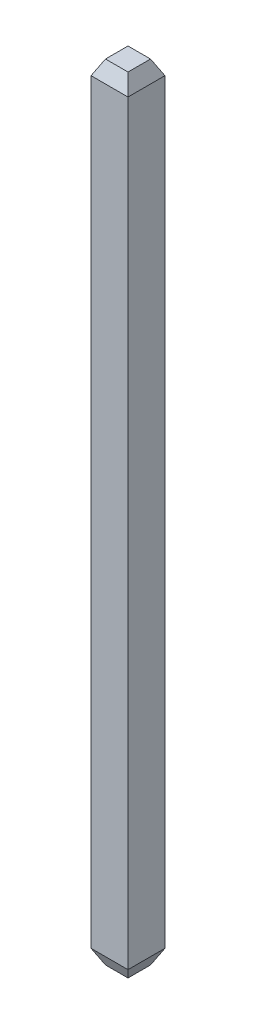
ISO-10303-21;
HEADER;
FILE_DESCRIPTION(('STEP AP214'),'2;1');
FILE_NAME('part.step','',(''),(''),'','','');
FILE_SCHEMA(('AUTOMOTIVE_DESIGN { 1 0 10303 214 1 1 1 1 }'));
ENDSEC;
DATA;
#1=APPLICATION_CONTEXT('core data for automotive mechanical design processes');
#2=APPLICATION_PROTOCOL_DEFINITION('international standard','automotive_design',2000,#1);
#3=PRODUCT_CONTEXT('',#1,'mechanical');
#4=PRODUCT('Part','Part','',(#3));
#5=PRODUCT_RELATED_PRODUCT_CATEGORY('part','',(#4));
#6=PRODUCT_DEFINITION_FORMATION('','',#4);
#7=PRODUCT_DEFINITION_CONTEXT('part definition',#1,'design');
#8=PRODUCT_DEFINITION('design','',#6,#7);
#9=PRODUCT_DEFINITION_SHAPE('','',#8);
#10=(LENGTH_UNIT() NAMED_UNIT(*) SI_UNIT(.MILLI.,.METRE.));
#11=(NAMED_UNIT(*) PLANE_ANGLE_UNIT() SI_UNIT($,.RADIAN.));
#12=(NAMED_UNIT(*) SI_UNIT($,.STERADIAN.) SOLID_ANGLE_UNIT());
#13=UNCERTAINTY_MEASURE_WITH_UNIT(LENGTH_MEASURE(1.E-05),#10,'distance_accuracy_value','');
#14=(GEOMETRIC_REPRESENTATION_CONTEXT(3) GLOBAL_UNCERTAINTY_ASSIGNED_CONTEXT((#13)) GLOBAL_UNIT_ASSIGNED_CONTEXT((#10,
#11,#12)) REPRESENTATION_CONTEXT('',''));
#15=CARTESIAN_POINT('',(0.,0.,0.));
#16=DIRECTION('',(0.,0.,1.));
#17=DIRECTION('',(1.,0.,0.));
#18=AXIS2_PLACEMENT_3D('',#15,#16,#17);
#19=CARTESIAN_POINT('',(0.32,13.59,-0.32));
#20=DIRECTION('',(-1.,0.,0.));
#21=DIRECTION('',(0.,0.,1.));
#22=AXIS2_PLACEMENT_3D('',#19,#20,#21);
#23=PLANE('',#22);
#24=DIRECTION('',(0.,-1.,0.));
#25=VECTOR('',#24,1.);
#26=CARTESIAN_POINT('',(0.32,13.59,0.32));
#27=LINE('',#26,#25);
#28=CARTESIAN_POINT('',(0.32,13.34,0.32));
#29=VERTEX_POINT('',#28);
#30=CARTESIAN_POINT('',(0.32,0.25,0.32));
#31=VERTEX_POINT('',#30);
#32=EDGE_CURVE('E121',#29,#31,#27,.T.);
#33=ORIENTED_EDGE('',*,*,#32,.T.);
#34=DIRECTION('',(0.,0.,-1.));
#35=VECTOR('',#34,1.);
#36=CARTESIAN_POINT('',(0.32,0.25,-0.32));
#37=LINE('',#36,#35);
#38=CARTESIAN_POINT('',(0.32,0.25,-0.32));
#39=VERTEX_POINT('',#38);
#40=EDGE_CURVE('E11',#31,#39,#37,.T.);
#41=ORIENTED_EDGE('',*,*,#40,.T.);
#42=DIRECTION('',(0.,-1.,0.));
#43=VECTOR('',#42,1.);
#44=CARTESIAN_POINT('',(0.32,13.59,-0.32));
#45=LINE('',#44,#43);
#46=CARTESIAN_POINT('',(0.32,13.34,-0.32));
#47=VERTEX_POINT('',#46);
#48=EDGE_CURVE('E127',#47,#39,#45,.T.);
#49=ORIENTED_EDGE('',*,*,#48,.F.);
#50=DIRECTION('',(0.,0.,1.));
#51=VECTOR('',#50,1.);
#52=CARTESIAN_POINT('',(0.32,13.34,0.32));
#53=LINE('',#52,#51);
#54=EDGE_CURVE('E143',#47,#29,#53,.T.);
#55=ORIENTED_EDGE('',*,*,#54,.T.);
#56=EDGE_LOOP('',(#33,#41,#49,#55));
#57=FACE_BOUND('',#56,.T.);
#58=ADVANCED_FACE('F34',(#57),#23,.F.);
#59=CARTESIAN_POINT('',(-0.32,13.59,-0.32));
#60=DIRECTION('',(0.,0.,1.));
#61=DIRECTION('',(1.,0.,0.));
#62=AXIS2_PLACEMENT_3D('',#59,#60,#61);
#63=PLANE('',#62);
#64=ORIENTED_EDGE('',*,*,#48,.T.);
#65=DIRECTION('',(-1.,0.,0.));
#66=VECTOR('',#65,1.);
#67=CARTESIAN_POINT('',(-0.32,0.25,-0.32));
#68=LINE('',#67,#66);
#69=CARTESIAN_POINT('',(-0.32,0.25,-0.32));
#70=VERTEX_POINT('',#69);
#71=EDGE_CURVE('E145',#39,#70,#68,.T.);
#72=ORIENTED_EDGE('',*,*,#71,.T.);
#73=DIRECTION('',(0.,-1.,0.));
#74=VECTOR('',#73,1.);
#75=CARTESIAN_POINT('',(-0.32,13.59,-0.32));
#76=LINE('',#75,#74);
#77=CARTESIAN_POINT('',(-0.32,13.34,-0.32));
#78=VERTEX_POINT('',#77);
#79=EDGE_CURVE('E130',#78,#70,#76,.T.);
#80=ORIENTED_EDGE('',*,*,#79,.F.);
#81=DIRECTION('',(1.,0.,0.));
#82=VECTOR('',#81,1.);
#83=CARTESIAN_POINT('',(0.32,13.34,-0.32));
#84=LINE('',#83,#82);
#85=EDGE_CURVE('E137',#78,#47,#84,.T.);
#86=ORIENTED_EDGE('',*,*,#85,.T.);
#87=EDGE_LOOP('',(#64,#72,#80,#86));
#88=FACE_BOUND('',#87,.T.);
#89=ADVANCED_FACE('F190',(#88),#63,.F.);
#90=CARTESIAN_POINT('',(-0.32,13.59,-0.32));
#91=DIRECTION('',(1.,0.,0.));
#92=DIRECTION('',(0.,0.,-1.));
#93=AXIS2_PLACEMENT_3D('',#90,#91,#92);
#94=PLANE('',#93);
#95=ORIENTED_EDGE('',*,*,#79,.T.);
#96=DIRECTION('',(0.,0.,1.));
#97=VECTOR('',#96,1.);
#98=CARTESIAN_POINT('',(-0.32,0.25,-0.32));
#99=LINE('',#98,#97);
#100=CARTESIAN_POINT('',(-0.32,0.25,0.32));
#101=VERTEX_POINT('',#100);
#102=EDGE_CURVE('E58',#70,#101,#99,.T.);
#103=ORIENTED_EDGE('',*,*,#102,.T.);
#104=DIRECTION('',(0.,-1.,0.));
#105=VECTOR('',#104,1.);
#106=CARTESIAN_POINT('',(-0.32,13.59,0.32));
#107=LINE('',#106,#105);
#108=CARTESIAN_POINT('',(-0.32,13.34,0.32));
#109=VERTEX_POINT('',#108);
#110=EDGE_CURVE('E195',#109,#101,#107,.T.);
#111=ORIENTED_EDGE('',*,*,#110,.F.);
#112=DIRECTION('',(0.,0.,-1.));
#113=VECTOR('',#112,1.);
#114=CARTESIAN_POINT('',(-0.32,13.34,-0.32));
#115=LINE('',#114,#113);
#116=EDGE_CURVE('E140',#109,#78,#115,.T.);
#117=ORIENTED_EDGE('',*,*,#116,.T.);
#118=EDGE_LOOP('',(#95,#103,#111,#117));
#119=FACE_BOUND('',#118,.T.);
#120=ADVANCED_FACE('F193',(#119),#94,.F.);
#121=CARTESIAN_POINT('',(-0.32,13.59,0.32));
#122=DIRECTION('',(0.,0.,-1.));
#123=DIRECTION('',(-1.,0.,0.));
#124=AXIS2_PLACEMENT_3D('',#121,#122,#123);
#125=PLANE('',#124);
#126=ORIENTED_EDGE('',*,*,#110,.T.);
#127=DIRECTION('',(1.,0.,0.));
#128=VECTOR('',#127,1.);
#129=CARTESIAN_POINT('',(-0.32,0.25,0.32));
#130=LINE('',#129,#128);
#131=EDGE_CURVE('E43',#101,#31,#130,.T.);
#132=ORIENTED_EDGE('',*,*,#131,.T.);
#133=ORIENTED_EDGE('',*,*,#32,.F.);
#134=DIRECTION('',(-1.,0.,0.));
#135=VECTOR('',#134,1.);
#136=CARTESIAN_POINT('',(-0.32,13.34,0.32));
#137=LINE('',#136,#135);
#138=EDGE_CURVE('E118',#29,#109,#137,.T.);
#139=ORIENTED_EDGE('',*,*,#138,.T.);
#140=EDGE_LOOP('',(#126,#132,#133,#139));
#141=FACE_BOUND('',#140,.T.);
#142=ADVANCED_FACE('F199',(#141),#125,.F.);
#143=CARTESIAN_POINT('',(0.32,13.59,0.32));
#144=DIRECTION('',(0.,1.,0.));
#145=DIRECTION('',(0.,0.,1.));
#146=AXIS2_PLACEMENT_3D('',#143,#144,#145);
#147=PLANE('',#146);
#148=DIRECTION('',(0.,0.,-1.));
#149=VECTOR('',#148,1.);
#150=CARTESIAN_POINT('',(0.195,13.59,-0.32));
#151=LINE('',#150,#149);
#152=CARTESIAN_POINT('',(0.195,13.59,0.194999999999999));
#153=VERTEX_POINT('',#152);
#154=CARTESIAN_POINT('',(0.195,13.59,-0.195));
#155=VERTEX_POINT('',#154);
#156=EDGE_CURVE('E106',#153,#155,#151,.T.);
#157=ORIENTED_EDGE('',*,*,#156,.T.);
#158=DIRECTION('',(-1.,0.,0.));
#159=VECTOR('',#158,1.);
#160=CARTESIAN_POINT('',(-0.32,13.59,-0.195));
#161=LINE('',#160,#159);
#162=CARTESIAN_POINT('',(-0.195,13.59,-0.195));
#163=VERTEX_POINT('',#162);
#164=EDGE_CURVE('E135',#155,#163,#161,.T.);
#165=ORIENTED_EDGE('',*,*,#164,.T.);
#166=DIRECTION('',(0.,0.,1.));
#167=VECTOR('',#166,1.);
#168=CARTESIAN_POINT('',(-0.195,13.59,0.32));
#169=LINE('',#168,#167);
#170=CARTESIAN_POINT('',(-0.195,13.59,0.195));
#171=VERTEX_POINT('',#170);
#172=EDGE_CURVE('E109',#163,#171,#169,.T.);
#173=ORIENTED_EDGE('',*,*,#172,.T.);
#174=DIRECTION('',(1.,0.,0.));
#175=VECTOR('',#174,1.);
#176=CARTESIAN_POINT('',(0.32,13.59,0.194999999999999));
#177=LINE('',#176,#175);
#178=EDGE_CURVE('E101',#171,#153,#177,.T.);
#179=ORIENTED_EDGE('',*,*,#178,.T.);
#180=EDGE_LOOP('',(#157,#165,#173,#179));
#181=FACE_BOUND('',#180,.T.);
#182=ADVANCED_FACE('F103',(#181),#147,.T.);
#183=CARTESIAN_POINT('',(0.32,0.,0.32));
#184=DIRECTION('',(0.,1.,0.));
#185=DIRECTION('',(0.,0.,1.));
#186=AXIS2_PLACEMENT_3D('',#183,#184,#185);
#187=PLANE('',#186);
#188=DIRECTION('',(0.,0.,-1.));
#189=VECTOR('',#188,1.);
#190=CARTESIAN_POINT('',(-0.195000000000001,0.,0.32));
#191=LINE('',#190,#189);
#192=CARTESIAN_POINT('',(-0.195000000000001,0.,0.195));
#193=VERTEX_POINT('',#192);
#194=CARTESIAN_POINT('',(-0.195000000000001,0.,-0.195000000000001));
#195=VERTEX_POINT('',#194);
#196=EDGE_CURVE('E156',#193,#195,#191,.T.);
#197=ORIENTED_EDGE('',*,*,#196,.T.);
#198=DIRECTION('',(1.,0.,0.));
#199=VECTOR('',#198,1.);
#200=CARTESIAN_POINT('',(0.32,0.,-0.195000000000001));
#201=LINE('',#200,#199);
#202=CARTESIAN_POINT('',(0.195000000000001,0.,-0.195000000000001));
#203=VERTEX_POINT('',#202);
#204=EDGE_CURVE('E158',#195,#203,#201,.T.);
#205=ORIENTED_EDGE('',*,*,#204,.T.);
#206=DIRECTION('',(0.,0.,1.));
#207=VECTOR('',#206,1.);
#208=CARTESIAN_POINT('',(0.195000000000001,0.,0.32));
#209=LINE('',#208,#207);
#210=CARTESIAN_POINT('',(0.195000000000001,0.,0.195));
#211=VERTEX_POINT('',#210);
#212=EDGE_CURVE('E152',#203,#211,#209,.T.);
#213=ORIENTED_EDGE('',*,*,#212,.T.);
#214=DIRECTION('',(-1.,0.,0.));
#215=VECTOR('',#214,1.);
#216=CARTESIAN_POINT('',(0.32,0.,0.195));
#217=LINE('',#216,#215);
#218=EDGE_CURVE('E154',#211,#193,#217,.T.);
#219=ORIENTED_EDGE('',*,*,#218,.T.);
#220=EDGE_LOOP('',(#197,#205,#213,#219));
#221=FACE_BOUND('',#220,.T.);
#222=ADVANCED_FACE('F181',(#221),#187,.F.);
#223=CARTESIAN_POINT('',(0.32,13.59,0.194999999999999));
#224=DIRECTION('',(0.,0.447213595499955,0.894427190999917));
#225=DIRECTION('',(0.,-0.894427190999917,0.447213595499956));
#226=AXIS2_PLACEMENT_3D('',#223,#224,#225);
#227=PLANE('',#226);
#228=DIRECTION('',(-0.408248290463861,-0.816496580927728,0.408248290463861));
#229=VECTOR('',#228,1.);
#230=CARTESIAN_POINT('',(-0.109166666666667,13.7616666666667,0.109166666666667));
#231=LINE('',#230,#229);
#232=EDGE_CURVE('E122',#109,#171,#231,.F.);
#233=ORIENTED_EDGE('',*,*,#232,.F.);
#234=ORIENTED_EDGE('',*,*,#138,.F.);
#235=DIRECTION('',(0.408248290463861,-0.816496580927728,0.408248290463861));
#236=VECTOR('',#235,1.);
#237=CARTESIAN_POINT('',(0.215833333333333,13.5483333333333,0.215833333333333));
#238=LINE('',#237,#236);
#239=EDGE_CURVE('E116',#153,#29,#238,.T.);
#240=ORIENTED_EDGE('',*,*,#239,.F.);
#241=ORIENTED_EDGE('',*,*,#178,.F.);
#242=EDGE_LOOP('',(#233,#234,#240,#241));
#243=FACE_BOUND('',#242,.T.);
#244=ADVANCED_FACE('F117',(#243),#227,.T.);
#245=CARTESIAN_POINT('',(0.195,13.59,0.32));
#246=DIRECTION('',(0.894427190999917,0.447213595499955,0.));
#247=DIRECTION('',(-0.447213595499956,0.894427190999917,0.));
#248=AXIS2_PLACEMENT_3D('',#245,#246,#247);
#249=PLANE('',#248);
#250=ORIENTED_EDGE('',*,*,#239,.T.);
#251=ORIENTED_EDGE('',*,*,#54,.F.);
#252=DIRECTION('',(-0.408248290463861,0.816496580927728,0.408248290463861));
#253=VECTOR('',#252,1.);
#254=CARTESIAN_POINT('',(0.109166666666668,13.7616666666667,-0.109166666666668));
#255=LINE('',#254,#253);
#256=EDGE_CURVE('E125',#155,#47,#255,.F.);
#257=ORIENTED_EDGE('',*,*,#256,.F.);
#258=ORIENTED_EDGE('',*,*,#156,.F.);
#259=EDGE_LOOP('',(#250,#251,#257,#258));
#260=FACE_BOUND('',#259,.T.);
#261=ADVANCED_FACE('F124',(#260),#249,.T.);
#262=CARTESIAN_POINT('',(-0.195,13.59,0.32));
#263=DIRECTION('',(-0.894427190999917,0.447213595499955,0.));
#264=DIRECTION('',(-0.447213595499956,-0.894427190999917,0.));
#265=AXIS2_PLACEMENT_3D('',#262,#263,#264);
#266=PLANE('',#265);
#267=ORIENTED_EDGE('',*,*,#232,.T.);
#268=ORIENTED_EDGE('',*,*,#172,.F.);
#269=DIRECTION('',(-0.408248290463861,-0.816496580927728,-0.408248290463861));
#270=VECTOR('',#269,1.);
#271=CARTESIAN_POINT('',(-0.109166666666667,13.7616666666667,-0.109166666666668));
#272=LINE('',#271,#270);
#273=EDGE_CURVE('E146',#78,#163,#272,.F.);
#274=ORIENTED_EDGE('',*,*,#273,.F.);
#275=ORIENTED_EDGE('',*,*,#116,.F.);
#276=EDGE_LOOP('',(#267,#268,#274,#275));
#277=FACE_BOUND('',#276,.T.);
#278=ADVANCED_FACE('F202',(#277),#266,.T.);
#279=CARTESIAN_POINT('',(0.32,13.59,-0.195));
#280=DIRECTION('',(0.,0.447213595499955,-0.894427190999917));
#281=DIRECTION('',(0.,0.894427190999917,0.447213595499956));
#282=AXIS2_PLACEMENT_3D('',#279,#280,#281);
#283=PLANE('',#282);
#284=ORIENTED_EDGE('',*,*,#256,.T.);
#285=ORIENTED_EDGE('',*,*,#85,.F.);
#286=ORIENTED_EDGE('',*,*,#273,.T.);
#287=ORIENTED_EDGE('',*,*,#164,.F.);
#288=EDGE_LOOP('',(#284,#285,#286,#287));
#289=FACE_BOUND('',#288,.T.);
#290=ADVANCED_FACE('F204',(#289),#283,.T.);
#291=CARTESIAN_POINT('',(-0.32,0.25,0.32));
#292=DIRECTION('',(0.,0.447213595499955,-0.894427190999917));
#293=DIRECTION('',(0.,0.894427190999917,0.447213595499956));
#294=AXIS2_PLACEMENT_3D('',#291,#292,#293);
#295=PLANE('',#294);
#296=DIRECTION('',(0.408248290463861,-0.816496580927728,-0.408248290463861));
#297=VECTOR('',#296,1.);
#298=CARTESIAN_POINT('',(-0.32,0.25,0.32));
#299=LINE('',#298,#297);
#300=EDGE_CURVE('E166',#193,#101,#299,.F.);
#301=ORIENTED_EDGE('',*,*,#300,.F.);
#302=ORIENTED_EDGE('',*,*,#218,.F.);
#303=DIRECTION('',(-0.408248290463861,-0.816496580927728,-0.408248290463861));
#304=VECTOR('',#303,1.);
#305=CARTESIAN_POINT('',(0.213333333333335,0.0366666666666674,0.213333333333334));
#306=LINE('',#305,#304);
#307=EDGE_CURVE('E38',#31,#211,#306,.T.);
#308=ORIENTED_EDGE('',*,*,#307,.F.);
#309=ORIENTED_EDGE('',*,*,#131,.F.);
#310=EDGE_LOOP('',(#301,#302,#308,#309));
#311=FACE_BOUND('',#310,.T.);
#312=ADVANCED_FACE('F36',(#311),#295,.F.);
#313=CARTESIAN_POINT('',(0.32,0.25,-0.32));
#314=DIRECTION('',(-0.894427190999917,0.447213595499955,0.));
#315=DIRECTION('',(-0.447213595499956,-0.894427190999917,0.));
#316=AXIS2_PLACEMENT_3D('',#313,#314,#315);
#317=PLANE('',#316);
#318=ORIENTED_EDGE('',*,*,#307,.T.);
#319=ORIENTED_EDGE('',*,*,#212,.F.);
#320=DIRECTION('',(0.408248290463861,0.816496580927728,-0.408248290463861));
#321=VECTOR('',#320,1.);
#322=CARTESIAN_POINT('',(0.32,0.25,-0.32));
#323=LINE('',#322,#321);
#324=EDGE_CURVE('E165',#39,#203,#323,.F.);
#325=ORIENTED_EDGE('',*,*,#324,.F.);
#326=ORIENTED_EDGE('',*,*,#40,.F.);
#327=EDGE_LOOP('',(#318,#319,#325,#326));
#328=FACE_BOUND('',#327,.T.);
#329=ADVANCED_FACE('F176',(#328),#317,.F.);
#330=CARTESIAN_POINT('',(-0.32,0.25,-0.32));
#331=DIRECTION('',(0.894427190999917,0.447213595499955,0.));
#332=DIRECTION('',(-0.447213595499956,0.894427190999917,0.));
#333=AXIS2_PLACEMENT_3D('',#330,#331,#332);
#334=PLANE('',#333);
#335=ORIENTED_EDGE('',*,*,#300,.T.);
#336=ORIENTED_EDGE('',*,*,#102,.F.);
#337=DIRECTION('',(0.408248290463861,-0.816496580927728,0.408248290463861));
#338=VECTOR('',#337,1.);
#339=CARTESIAN_POINT('',(-0.32,0.25,-0.32));
#340=LINE('',#339,#338);
#341=EDGE_CURVE('E163',#195,#70,#340,.F.);
#342=ORIENTED_EDGE('',*,*,#341,.F.);
#343=ORIENTED_EDGE('',*,*,#196,.F.);
#344=EDGE_LOOP('',(#335,#336,#342,#343));
#345=FACE_BOUND('',#344,.T.);
#346=ADVANCED_FACE('F187',(#345),#334,.F.);
#347=CARTESIAN_POINT('',(-0.32,0.25,-0.32));
#348=DIRECTION('',(0.,0.447213595499955,0.894427190999917));
#349=DIRECTION('',(0.,-0.894427190999917,0.447213595499956));
#350=AXIS2_PLACEMENT_3D('',#347,#348,#349);
#351=PLANE('',#350);
#352=ORIENTED_EDGE('',*,*,#324,.T.);
#353=ORIENTED_EDGE('',*,*,#204,.F.);
#354=ORIENTED_EDGE('',*,*,#341,.T.);
#355=ORIENTED_EDGE('',*,*,#71,.F.);
#356=EDGE_LOOP('',(#352,#353,#354,#355));
#357=FACE_BOUND('',#356,.T.);
#358=ADVANCED_FACE('F185',(#357),#351,.F.);
#359=CLOSED_SHELL('',(#58,#89,#120,#142,#182,#222,#244,#261,#278,#290,#312,#329,#346,#358));
#360=MANIFOLD_SOLID_BREP('B2',#359);
#361=ADVANCED_BREP_SHAPE_REPRESENTATION('',(#18,#360),#14);
#362=SHAPE_DEFINITION_REPRESENTATION(#9,#361);
ENDSEC;
END-ISO-10303-21;
